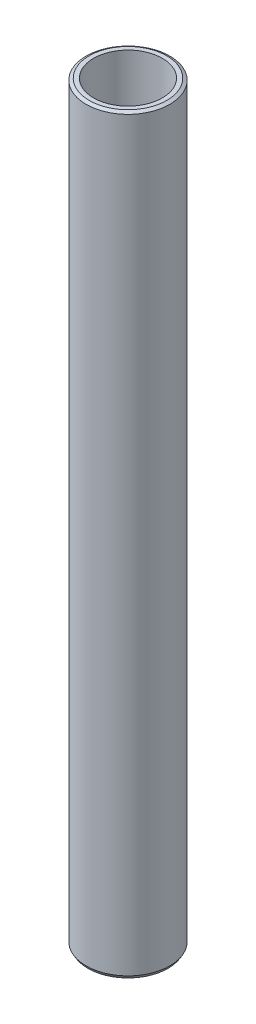
ISO-10303-21;
HEADER;
FILE_DESCRIPTION(('STEP AP214'),'2;1');
FILE_NAME('part.step','',(''),(''),'','','');
FILE_SCHEMA(('AUTOMOTIVE_DESIGN { 1 0 10303 214 1 1 1 1 }'));
ENDSEC;
DATA;
#1=APPLICATION_CONTEXT('core data for automotive mechanical design processes');
#2=APPLICATION_PROTOCOL_DEFINITION('international standard','automotive_design',2000,#1);
#3=PRODUCT_CONTEXT('',#1,'mechanical');
#4=PRODUCT('Part','Part','',(#3));
#5=PRODUCT_RELATED_PRODUCT_CATEGORY('part','',(#4));
#6=PRODUCT_DEFINITION_FORMATION('','',#4);
#7=PRODUCT_DEFINITION_CONTEXT('part definition',#1,'design');
#8=PRODUCT_DEFINITION('design','',#6,#7);
#9=PRODUCT_DEFINITION_SHAPE('','',#8);
#10=(LENGTH_UNIT() NAMED_UNIT(*) SI_UNIT(.MILLI.,.METRE.));
#11=(NAMED_UNIT(*) PLANE_ANGLE_UNIT() SI_UNIT($,.RADIAN.));
#12=(NAMED_UNIT(*) SI_UNIT($,.STERADIAN.) SOLID_ANGLE_UNIT());
#13=UNCERTAINTY_MEASURE_WITH_UNIT(LENGTH_MEASURE(1.E-05),#10,'distance_accuracy_value','');
#14=(GEOMETRIC_REPRESENTATION_CONTEXT(3) GLOBAL_UNCERTAINTY_ASSIGNED_CONTEXT((#13)) GLOBAL_UNIT_ASSIGNED_CONTEXT((#10,
#11,#12)) REPRESENTATION_CONTEXT('',''));
#15=CARTESIAN_POINT('',(0.,0.,0.));
#16=DIRECTION('',(0.,0.,1.));
#17=DIRECTION('',(1.,0.,0.));
#18=AXIS2_PLACEMENT_3D('',#15,#16,#17);
#19=CARTESIAN_POINT('',(0.,538.245512759707,0.));
#20=DIRECTION('',(0.,-1.,0.));
#21=DIRECTION('',(0.,0.,-1.));
#22=AXIS2_PLACEMENT_3D('',#19,#20,#21);
#23=CYLINDRICAL_SURFACE('',#22,30.);
#24=CARTESIAN_POINT('',(0.,536.959800703665,0.));
#25=DIRECTION('',(0.,1.,0.));
#26=DIRECTION('',(0.,0.,1.));
#27=AXIS2_PLACEMENT_3D('',#24,#25,#26);
#28=CIRCLE('',#27,30.);
#29=CARTESIAN_POINT('',(0.,536.959800703665,30.));
#30=VERTEX_POINT('',#29);
#31=EDGE_CURVE('E50',#30,#30,#28,.F.);
#32=ORIENTED_EDGE('',*,*,#31,.T.);
#33=EDGE_LOOP('',(#32));
#34=FACE_BOUND('',#33,.T.);
#35=CARTESIAN_POINT('',(0.,2.22691860496915,0.));
#36=DIRECTION('',(0.,1.,0.));
#37=DIRECTION('',(0.,0.,1.));
#38=AXIS2_PLACEMENT_3D('',#35,#36,#37);
#39=CIRCLE('',#38,30.);
#40=CARTESIAN_POINT('',(0.,2.22691860496915,30.));
#41=VERTEX_POINT('',#40);
#42=EDGE_CURVE('E51',#41,#41,#39,.T.);
#43=ORIENTED_EDGE('',*,*,#42,.T.);
#44=EDGE_LOOP('',(#43));
#45=FACE_BOUND('',#44,.T.);
#46=ADVANCED_FACE('F39',(#34,#45),#23,.T.);
#47=CARTESIAN_POINT('',(0.,538.245512759707,0.));
#48=DIRECTION('',(0.,1.,0.));
#49=DIRECTION('',(0.,0.,1.));
#50=AXIS2_PLACEMENT_3D('',#47,#48,#49);
#51=PLANE('',#50);
#52=CARTESIAN_POINT('',(0.,538.245512759707,0.));
#53=DIRECTION('',(0.,1.,0.));
#54=DIRECTION('',(0.,0.,1.));
#55=AXIS2_PLACEMENT_3D('',#52,#53,#54);
#56=CIRCLE('',#55,27.773081395031);
#57=CARTESIAN_POINT('',(0.,538.245512759707,27.773081395031));
#58=VERTEX_POINT('',#57);
#59=EDGE_CURVE('E54',#58,#58,#56,.T.);
#60=ORIENTED_EDGE('',*,*,#59,.T.);
#61=EDGE_LOOP('',(#60));
#62=FACE_BOUND('',#61,.T.);
#63=CARTESIAN_POINT('',(0.,538.245512759707,0.));
#64=DIRECTION('',(0.,1.,0.));
#65=DIRECTION('',(0.,0.,1.));
#66=AXIS2_PLACEMENT_3D('',#63,#64,#65);
#67=CIRCLE('',#66,24.6408897297403);
#68=CARTESIAN_POINT('',(0.,538.245512759707,24.6408897297403));
#69=VERTEX_POINT('',#68);
#70=EDGE_CURVE('E58',#69,#69,#67,.T.);
#71=ORIENTED_EDGE('',*,*,#70,.F.);
#72=EDGE_LOOP('',(#71));
#73=FACE_BOUND('',#72,.T.);
#74=ADVANCED_FACE('F69',(#62,#73),#51,.T.);
#75=CARTESIAN_POINT('',(0.,0.,0.));
#76=DIRECTION('',(0.,1.,0.));
#77=DIRECTION('',(0.,0.,1.));
#78=AXIS2_PLACEMENT_3D('',#75,#76,#77);
#79=PLANE('',#78);
#80=CARTESIAN_POINT('',(0.,0.,0.));
#81=DIRECTION('',(0.,1.,0.));
#82=DIRECTION('',(0.,0.,1.));
#83=AXIS2_PLACEMENT_3D('',#80,#81,#82);
#84=CIRCLE('',#83,28.7142879439576);
#85=CARTESIAN_POINT('',(0.,0.,28.7142879439576));
#86=VERTEX_POINT('',#85);
#87=EDGE_CURVE('E10',#86,#86,#84,.F.);
#88=ORIENTED_EDGE('',*,*,#87,.T.);
#89=EDGE_LOOP('',(#88));
#90=FACE_BOUND('',#89,.T.);
#91=CARTESIAN_POINT('',(0.,0.,0.));
#92=DIRECTION('',(0.,1.,0.));
#93=DIRECTION('',(0.,0.,1.));
#94=AXIS2_PLACEMENT_3D('',#91,#92,#93);
#95=CIRCLE('',#94,24.6408897297403);
#96=CARTESIAN_POINT('',(0.,0.,24.6408897297403));
#97=VERTEX_POINT('',#96);
#98=EDGE_CURVE('E63',#97,#97,#95,.T.);
#99=ORIENTED_EDGE('',*,*,#98,.T.);
#100=EDGE_LOOP('',(#99));
#101=FACE_BOUND('',#100,.T.);
#102=ADVANCED_FACE('F75',(#90,#101),#79,.F.);
#103=CARTESIAN_POINT('',(0.,538.245512759707,0.));
#104=DIRECTION('',(0.,-1.,0.));
#105=DIRECTION('',(0.,0.,-1.));
#106=AXIS2_PLACEMENT_3D('',#103,#104,#105);
#107=CYLINDRICAL_SURFACE('',#106,24.6408897297403);
#108=ORIENTED_EDGE('',*,*,#70,.T.);
#109=EDGE_LOOP('',(#108));
#110=FACE_BOUND('',#109,.T.);
#111=ORIENTED_EDGE('',*,*,#98,.F.);
#112=EDGE_LOOP('',(#111));
#113=FACE_BOUND('',#112,.T.);
#114=ADVANCED_FACE('F70',(#110,#113),#107,.F.);
#115=CARTESIAN_POINT('',(0.,538.245512759707,0.));
#116=DIRECTION('',(0.,-1.,0.));
#117=DIRECTION('',(0.,0.,-1.));
#118=AXIS2_PLACEMENT_3D('',#115,#116,#117);
#119=CONICAL_SURFACE('',#118,27.773081395031,1.0471975511966);
#120=ORIENTED_EDGE('',*,*,#31,.F.);
#121=EDGE_LOOP('',(#120));
#122=FACE_BOUND('',#121,.T.);
#123=ORIENTED_EDGE('',*,*,#59,.F.);
#124=EDGE_LOOP('',(#123));
#125=FACE_BOUND('',#124,.T.);
#126=ADVANCED_FACE('F81',(#122,#125),#119,.T.);
#127=CARTESIAN_POINT('',(0.,2.22691860496915,0.));
#128=DIRECTION('',(0.,1.,0.));
#129=DIRECTION('',(0.,0.,1.));
#130=AXIS2_PLACEMENT_3D('',#127,#128,#129);
#131=CONICAL_SURFACE('',#130,30.,0.52359877559831);
#132=ORIENTED_EDGE('',*,*,#87,.F.);
#133=EDGE_LOOP('',(#132));
#134=FACE_BOUND('',#133,.T.);
#135=ORIENTED_EDGE('',*,*,#42,.F.);
#136=EDGE_LOOP('',(#135));
#137=FACE_BOUND('',#136,.T.);
#138=ADVANCED_FACE('F45',(#134,#137),#131,.T.);
#139=CLOSED_SHELL('',(#46,#74,#102,#114,#126,#138));
#140=MANIFOLD_SOLID_BREP('B2',#139);
#141=ADVANCED_BREP_SHAPE_REPRESENTATION('',(#18,#140),#14);
#142=SHAPE_DEFINITION_REPRESENTATION(#9,#141);
ENDSEC;
END-ISO-10303-21;
